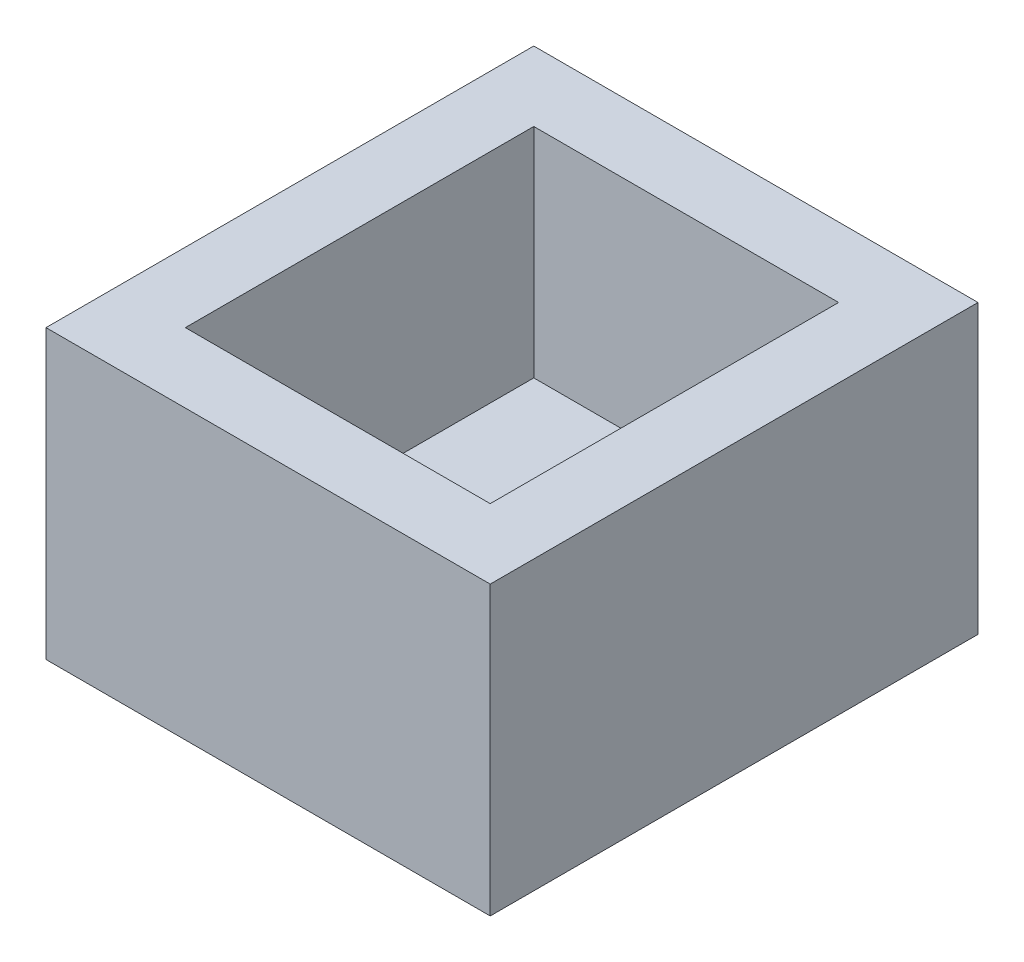
ISO-10303-21;
HEADER;
FILE_DESCRIPTION(('STEP AP214'),'2;1');
FILE_NAME('part.step','',(''),(''),'','','');
FILE_SCHEMA(('AUTOMOTIVE_DESIGN { 1 0 10303 214 1 1 1 1 }'));
ENDSEC;
DATA;
#1=APPLICATION_CONTEXT('core data for automotive mechanical design processes');
#2=APPLICATION_PROTOCOL_DEFINITION('international standard','automotive_design',2000,#1);
#3=PRODUCT_CONTEXT('',#1,'mechanical');
#4=PRODUCT('Part','Part','',(#3));
#5=PRODUCT_RELATED_PRODUCT_CATEGORY('part','',(#4));
#6=PRODUCT_DEFINITION_FORMATION('','',#4);
#7=PRODUCT_DEFINITION_CONTEXT('part definition',#1,'design');
#8=PRODUCT_DEFINITION('design','',#6,#7);
#9=PRODUCT_DEFINITION_SHAPE('','',#8);
#10=(LENGTH_UNIT() NAMED_UNIT(*) SI_UNIT(.MILLI.,.METRE.));
#11=(NAMED_UNIT(*) PLANE_ANGLE_UNIT() SI_UNIT($,.RADIAN.));
#12=(NAMED_UNIT(*) SI_UNIT($,.STERADIAN.) SOLID_ANGLE_UNIT());
#13=UNCERTAINTY_MEASURE_WITH_UNIT(LENGTH_MEASURE(1.E-05),#10,'distance_accuracy_value','');
#14=(GEOMETRIC_REPRESENTATION_CONTEXT(3) GLOBAL_UNCERTAINTY_ASSIGNED_CONTEXT((#13)) GLOBAL_UNIT_ASSIGNED_CONTEXT((#10,
#11,#12)) REPRESENTATION_CONTEXT('',''));
#15=CARTESIAN_POINT('',(0.,0.,0.));
#16=DIRECTION('',(0.,0.,1.));
#17=DIRECTION('',(1.,0.,0.));
#18=AXIS2_PLACEMENT_3D('',#15,#16,#17);
#19=CARTESIAN_POINT('',(102.,16.,0.));
#20=DIRECTION('',(0.,0.,1.));
#21=DIRECTION('',(1.,0.,0.));
#22=AXIS2_PLACEMENT_3D('',#19,#20,#21);
#23=PLANE('',#22);
#24=DIRECTION('',(-1.,0.,0.));
#25=VECTOR('',#24,1.);
#26=CARTESIAN_POINT('',(102.,0.,0.));
#27=LINE('',#26,#25);
#28=CARTESIAN_POINT('',(102.,0.,0.));
#29=VERTEX_POINT('',#28);
#30=CARTESIAN_POINT('',(0.,0.,0.));
#31=VERTEX_POINT('',#30);
#32=EDGE_CURVE('E143',#29,#31,#27,.T.);
#33=ORIENTED_EDGE('',*,*,#32,.T.);
#34=DIRECTION('',(0.,-1.,0.));
#35=VECTOR('',#34,1.);
#36=CARTESIAN_POINT('',(0.,16.,0.));
#37=LINE('',#36,#35);
#38=CARTESIAN_POINT('',(0.,66.,0.));
#39=VERTEX_POINT('',#38);
#40=EDGE_CURVE('E11',#39,#31,#37,.T.);
#41=ORIENTED_EDGE('',*,*,#40,.F.);
#42=DIRECTION('',(-1.,0.,0.));
#43=VECTOR('',#42,1.);
#44=CARTESIAN_POINT('',(0.,66.,0.));
#45=LINE('',#44,#43);
#46=CARTESIAN_POINT('',(102.,66.,0.));
#47=VERTEX_POINT('',#46);
#48=EDGE_CURVE('E140',#47,#39,#45,.T.);
#49=ORIENTED_EDGE('',*,*,#48,.F.);
#50=DIRECTION('',(0.,-1.,0.));
#51=VECTOR('',#50,1.);
#52=CARTESIAN_POINT('',(102.,16.,0.));
#53=LINE('',#52,#51);
#54=EDGE_CURVE('E152',#47,#29,#53,.T.);
#55=ORIENTED_EDGE('',*,*,#54,.T.);
#56=EDGE_LOOP('',(#33,#41,#49,#55));
#57=FACE_BOUND('',#56,.T.);
#58=ADVANCED_FACE('F32',(#57),#23,.F.);
#59=CARTESIAN_POINT('',(0.,16.,0.));
#60=DIRECTION('',(1.,0.,0.));
#61=DIRECTION('',(0.,0.,-1.));
#62=AXIS2_PLACEMENT_3D('',#59,#60,#61);
#63=PLANE('',#62);
#64=DIRECTION('',(0.,0.,1.));
#65=VECTOR('',#64,1.);
#66=CARTESIAN_POINT('',(0.,0.,0.));
#67=LINE('',#66,#65);
#68=CARTESIAN_POINT('',(0.,0.,112.));
#69=VERTEX_POINT('',#68);
#70=EDGE_CURVE('E146',#31,#69,#67,.T.);
#71=ORIENTED_EDGE('',*,*,#70,.T.);
#72=DIRECTION('',(0.,-1.,0.));
#73=VECTOR('',#72,1.);
#74=CARTESIAN_POINT('',(0.,16.,112.));
#75=LINE('',#74,#73);
#76=CARTESIAN_POINT('',(0.,66.,112.));
#77=VERTEX_POINT('',#76);
#78=EDGE_CURVE('E39',#77,#69,#75,.T.);
#79=ORIENTED_EDGE('',*,*,#78,.F.);
#80=DIRECTION('',(0.,0.,1.));
#81=VECTOR('',#80,1.);
#82=CARTESIAN_POINT('',(0.,66.,0.));
#83=LINE('',#82,#81);
#84=EDGE_CURVE('E110',#39,#77,#83,.T.);
#85=ORIENTED_EDGE('',*,*,#84,.F.);
#86=ORIENTED_EDGE('',*,*,#40,.T.);
#87=EDGE_LOOP('',(#71,#79,#85,#86));
#88=FACE_BOUND('',#87,.T.);
#89=ADVANCED_FACE('F174',(#88),#63,.F.);
#90=CARTESIAN_POINT('',(0.,16.,112.));
#91=DIRECTION('',(0.,0.,-1.));
#92=DIRECTION('',(-1.,0.,0.));
#93=AXIS2_PLACEMENT_3D('',#90,#91,#92);
#94=PLANE('',#93);
#95=DIRECTION('',(1.,0.,0.));
#96=VECTOR('',#95,1.);
#97=CARTESIAN_POINT('',(0.,0.,112.));
#98=LINE('',#97,#96);
#99=CARTESIAN_POINT('',(102.,0.,112.));
#100=VERTEX_POINT('',#99);
#101=EDGE_CURVE('E148',#69,#100,#98,.T.);
#102=ORIENTED_EDGE('',*,*,#101,.T.);
#103=DIRECTION('',(0.,-1.,0.));
#104=VECTOR('',#103,1.);
#105=CARTESIAN_POINT('',(102.,16.,112.));
#106=LINE('',#105,#104);
#107=CARTESIAN_POINT('',(102.,66.,112.));
#108=VERTEX_POINT('',#107);
#109=EDGE_CURVE('E155',#108,#100,#106,.T.);
#110=ORIENTED_EDGE('',*,*,#109,.F.);
#111=DIRECTION('',(1.,0.,0.));
#112=VECTOR('',#111,1.);
#113=CARTESIAN_POINT('',(0.,66.,112.));
#114=LINE('',#113,#112);
#115=EDGE_CURVE('E134',#77,#108,#114,.T.);
#116=ORIENTED_EDGE('',*,*,#115,.F.);
#117=ORIENTED_EDGE('',*,*,#78,.T.);
#118=EDGE_LOOP('',(#102,#110,#116,#117));
#119=FACE_BOUND('',#118,.T.);
#120=ADVANCED_FACE('F161',(#119),#94,.F.);
#121=CARTESIAN_POINT('',(102.,16.,112.));
#122=DIRECTION('',(-1.,0.,0.));
#123=DIRECTION('',(0.,0.,1.));
#124=AXIS2_PLACEMENT_3D('',#121,#122,#123);
#125=PLANE('',#124);
#126=DIRECTION('',(0.,0.,-1.));
#127=VECTOR('',#126,1.);
#128=CARTESIAN_POINT('',(102.,0.,112.));
#129=LINE('',#128,#127);
#130=EDGE_CURVE('E150',#100,#29,#129,.T.);
#131=ORIENTED_EDGE('',*,*,#130,.T.);
#132=ORIENTED_EDGE('',*,*,#54,.F.);
#133=DIRECTION('',(0.,0.,-1.));
#134=VECTOR('',#133,1.);
#135=CARTESIAN_POINT('',(102.,66.,0.));
#136=LINE('',#135,#134);
#137=EDGE_CURVE('E137',#108,#47,#136,.T.);
#138=ORIENTED_EDGE('',*,*,#137,.F.);
#139=ORIENTED_EDGE('',*,*,#109,.T.);
#140=EDGE_LOOP('',(#131,#132,#138,#139));
#141=FACE_BOUND('',#140,.T.);
#142=ADVANCED_FACE('F169',(#141),#125,.F.);
#143=CARTESIAN_POINT('',(0.,0.,0.));
#144=DIRECTION('',(0.,1.,0.));
#145=DIRECTION('',(0.,0.,1.));
#146=AXIS2_PLACEMENT_3D('',#143,#144,#145);
#147=PLANE('',#146);
#148=ORIENTED_EDGE('',*,*,#32,.F.);
#149=ORIENTED_EDGE('',*,*,#130,.F.);
#150=ORIENTED_EDGE('',*,*,#101,.F.);
#151=ORIENTED_EDGE('',*,*,#70,.F.);
#152=EDGE_LOOP('',(#148,#149,#150,#151));
#153=FACE_BOUND('',#152,.T.);
#154=ADVANCED_FACE('F167',(#153),#147,.F.);
#155=CARTESIAN_POINT('',(0.,66.,0.));
#156=DIRECTION('',(0.,1.,0.));
#157=DIRECTION('',(-1.,0.,0.));
#158=AXIS2_PLACEMENT_3D('',#155,#156,#157);
#159=PLANE('',#158);
#160=ORIENTED_EDGE('',*,*,#84,.T.);
#161=ORIENTED_EDGE('',*,*,#115,.T.);
#162=ORIENTED_EDGE('',*,*,#137,.T.);
#163=ORIENTED_EDGE('',*,*,#48,.T.);
#164=EDGE_LOOP('',(#160,#161,#162,#163));
#165=FACE_BOUND('',#164,.T.);
#166=DIRECTION('',(1.,0.,0.));
#167=VECTOR('',#166,1.);
#168=CARTESIAN_POINT('',(16.,66.,96.));
#169=LINE('',#168,#167);
#170=CARTESIAN_POINT('',(16.,66.,96.));
#171=VERTEX_POINT('',#170);
#172=CARTESIAN_POINT('',(86.,66.,96.));
#173=VERTEX_POINT('',#172);
#174=EDGE_CURVE('E104',#171,#173,#169,.T.);
#175=ORIENTED_EDGE('',*,*,#174,.F.);
#176=DIRECTION('',(0.,0.,1.));
#177=VECTOR('',#176,1.);
#178=CARTESIAN_POINT('',(16.,66.,16.));
#179=LINE('',#178,#177);
#180=CARTESIAN_POINT('',(16.,66.,16.));
#181=VERTEX_POINT('',#180);
#182=EDGE_CURVE('E95',#181,#171,#179,.T.);
#183=ORIENTED_EDGE('',*,*,#182,.F.);
#184=DIRECTION('',(-1.,0.,0.));
#185=VECTOR('',#184,1.);
#186=CARTESIAN_POINT('',(16.,66.,16.));
#187=LINE('',#186,#185);
#188=CARTESIAN_POINT('',(86.,66.,16.));
#189=VERTEX_POINT('',#188);
#190=EDGE_CURVE('E118',#189,#181,#187,.T.);
#191=ORIENTED_EDGE('',*,*,#190,.F.);
#192=DIRECTION('',(0.,0.,-1.));
#193=VECTOR('',#192,1.);
#194=CARTESIAN_POINT('',(86.,66.,16.));
#195=LINE('',#194,#193);
#196=EDGE_CURVE('E116',#173,#189,#195,.T.);
#197=ORIENTED_EDGE('',*,*,#196,.F.);
#198=EDGE_LOOP('',(#175,#183,#191,#197));
#199=FACE_BOUND('',#198,.T.);
#200=ADVANCED_FACE('F114',(#165,#199),#159,.T.);
#201=CARTESIAN_POINT('',(16.,66.,16.));
#202=DIRECTION('',(1.,0.,0.));
#203=DIRECTION('',(0.,0.,-1.));
#204=AXIS2_PLACEMENT_3D('',#201,#202,#203);
#205=PLANE('',#204);
#206=DIRECTION('',(0.,0.,1.));
#207=VECTOR('',#206,1.);
#208=CARTESIAN_POINT('',(16.,16.,16.));
#209=LINE('',#208,#207);
#210=CARTESIAN_POINT('',(16.,16.,16.));
#211=VERTEX_POINT('',#210);
#212=CARTESIAN_POINT('',(16.,16.,96.));
#213=VERTEX_POINT('',#212);
#214=EDGE_CURVE('E46',#211,#213,#209,.T.);
#215=ORIENTED_EDGE('',*,*,#214,.F.);
#216=DIRECTION('',(0.,-1.,0.));
#217=VECTOR('',#216,1.);
#218=CARTESIAN_POINT('',(16.,66.,16.));
#219=LINE('',#218,#217);
#220=EDGE_CURVE('E100',#181,#211,#219,.T.);
#221=ORIENTED_EDGE('',*,*,#220,.F.);
#222=ORIENTED_EDGE('',*,*,#182,.T.);
#223=DIRECTION('',(0.,-1.,0.));
#224=VECTOR('',#223,1.);
#225=CARTESIAN_POINT('',(16.,66.,96.));
#226=LINE('',#225,#224);
#227=EDGE_CURVE('E98',#171,#213,#226,.T.);
#228=ORIENTED_EDGE('',*,*,#227,.T.);
#229=EDGE_LOOP('',(#215,#221,#222,#228));
#230=FACE_BOUND('',#229,.T.);
#231=ADVANCED_FACE('F97',(#230),#205,.T.);
#232=CARTESIAN_POINT('',(16.,66.,96.));
#233=DIRECTION('',(0.,0.,-1.));
#234=DIRECTION('',(0.,1.,0.));
#235=AXIS2_PLACEMENT_3D('',#232,#233,#234);
#236=PLANE('',#235);
#237=DIRECTION('',(1.,0.,0.));
#238=VECTOR('',#237,1.);
#239=CARTESIAN_POINT('',(16.,16.,96.));
#240=LINE('',#239,#238);
#241=CARTESIAN_POINT('',(86.,16.,96.));
#242=VERTEX_POINT('',#241);
#243=EDGE_CURVE('E50',#213,#242,#240,.T.);
#244=ORIENTED_EDGE('',*,*,#243,.F.);
#245=ORIENTED_EDGE('',*,*,#227,.F.);
#246=ORIENTED_EDGE('',*,*,#174,.T.);
#247=DIRECTION('',(0.,-1.,0.));
#248=VECTOR('',#247,1.);
#249=CARTESIAN_POINT('',(86.,66.,96.));
#250=LINE('',#249,#248);
#251=EDGE_CURVE('E111',#173,#242,#250,.T.);
#252=ORIENTED_EDGE('',*,*,#251,.T.);
#253=EDGE_LOOP('',(#244,#245,#246,#252));
#254=FACE_BOUND('',#253,.T.);
#255=ADVANCED_FACE('F108',(#254),#236,.T.);
#256=CARTESIAN_POINT('',(86.,66.,16.));
#257=DIRECTION('',(-1.,0.,0.));
#258=DIRECTION('',(0.,0.,1.));
#259=AXIS2_PLACEMENT_3D('',#256,#257,#258);
#260=PLANE('',#259);
#261=DIRECTION('',(0.,0.,-1.));
#262=VECTOR('',#261,1.);
#263=CARTESIAN_POINT('',(86.,16.,16.));
#264=LINE('',#263,#262);
#265=CARTESIAN_POINT('',(86.,16.,16.));
#266=VERTEX_POINT('',#265);
#267=EDGE_CURVE('E124',#242,#266,#264,.T.);
#268=ORIENTED_EDGE('',*,*,#267,.F.);
#269=ORIENTED_EDGE('',*,*,#251,.F.);
#270=ORIENTED_EDGE('',*,*,#196,.T.);
#271=DIRECTION('',(0.,-1.,0.));
#272=VECTOR('',#271,1.);
#273=CARTESIAN_POINT('',(86.,66.,16.));
#274=LINE('',#273,#272);
#275=EDGE_CURVE('E128',#189,#266,#274,.T.);
#276=ORIENTED_EDGE('',*,*,#275,.T.);
#277=EDGE_LOOP('',(#268,#269,#270,#276));
#278=FACE_BOUND('',#277,.T.);
#279=ADVANCED_FACE('F196',(#278),#260,.T.);
#280=CARTESIAN_POINT('',(16.,66.,16.));
#281=DIRECTION('',(0.,0.,1.));
#282=DIRECTION('',(0.,-1.,0.));
#283=AXIS2_PLACEMENT_3D('',#280,#281,#282);
#284=PLANE('',#283);
#285=DIRECTION('',(-1.,0.,0.));
#286=VECTOR('',#285,1.);
#287=CARTESIAN_POINT('',(16.,16.,16.));
#288=LINE('',#287,#286);
#289=EDGE_CURVE('E105',#266,#211,#288,.T.);
#290=ORIENTED_EDGE('',*,*,#289,.F.);
#291=ORIENTED_EDGE('',*,*,#275,.F.);
#292=ORIENTED_EDGE('',*,*,#190,.T.);
#293=ORIENTED_EDGE('',*,*,#220,.T.);
#294=EDGE_LOOP('',(#290,#291,#292,#293));
#295=FACE_BOUND('',#294,.T.);
#296=ADVANCED_FACE('F189',(#295),#284,.T.);
#297=CARTESIAN_POINT('',(0.,16.,0.));
#298=DIRECTION('',(0.,1.,0.));
#299=DIRECTION('',(0.,0.,1.));
#300=AXIS2_PLACEMENT_3D('',#297,#298,#299);
#301=PLANE('',#300);
#302=ORIENTED_EDGE('',*,*,#214,.T.);
#303=ORIENTED_EDGE('',*,*,#243,.T.);
#304=ORIENTED_EDGE('',*,*,#267,.T.);
#305=ORIENTED_EDGE('',*,*,#289,.T.);
#306=EDGE_LOOP('',(#302,#303,#304,#305));
#307=FACE_BOUND('',#306,.T.);
#308=ADVANCED_FACE('F186',(#307),#301,.T.);
#309=CLOSED_SHELL('',(#58,#89,#120,#142,#154,#200,#231,#255,#279,#296,#308));
#310=MANIFOLD_SOLID_BREP('B2',#309);
#311=ADVANCED_BREP_SHAPE_REPRESENTATION('',(#18,#310),#14);
#312=SHAPE_DEFINITION_REPRESENTATION(#9,#311);
ENDSEC;
END-ISO-10303-21;
